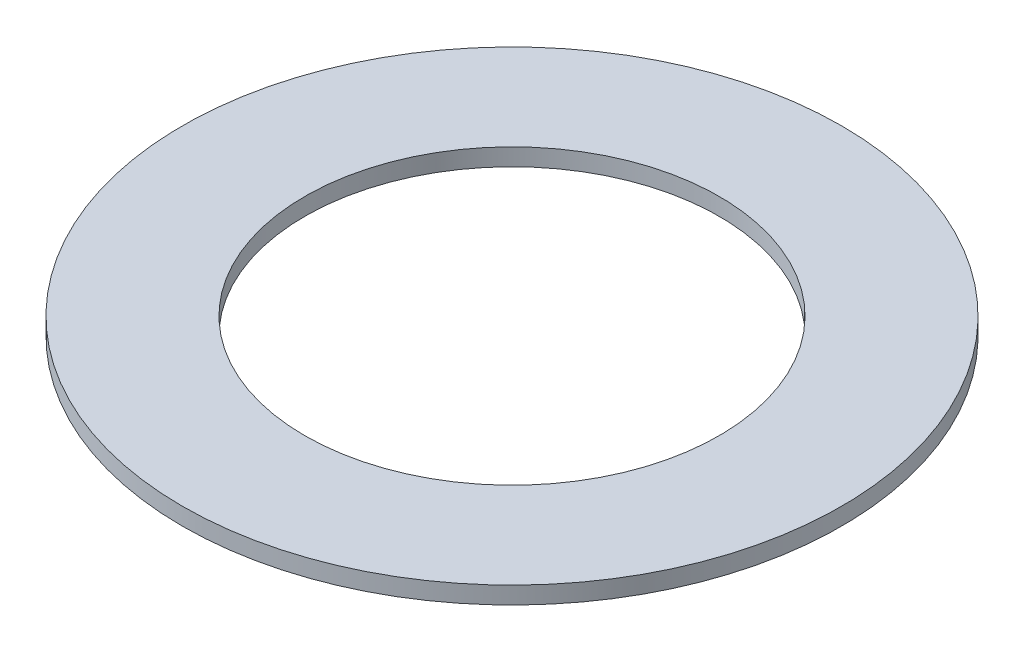
ISO-10303-21;
HEADER;
FILE_DESCRIPTION(('STEP AP214'),'2;1');
FILE_NAME('part.step','',(''),(''),'','','');
FILE_SCHEMA(('AUTOMOTIVE_DESIGN { 1 0 10303 214 1 1 1 1 }'));
ENDSEC;
DATA;
#1=APPLICATION_CONTEXT('core data for automotive mechanical design processes');
#2=APPLICATION_PROTOCOL_DEFINITION('international standard','automotive_design',2000,#1);
#3=PRODUCT_CONTEXT('',#1,'mechanical');
#4=PRODUCT('Part','Part','',(#3));
#5=PRODUCT_RELATED_PRODUCT_CATEGORY('part','',(#4));
#6=PRODUCT_DEFINITION_FORMATION('','',#4);
#7=PRODUCT_DEFINITION_CONTEXT('part definition',#1,'design');
#8=PRODUCT_DEFINITION('design','',#6,#7);
#9=PRODUCT_DEFINITION_SHAPE('','',#8);
#10=(LENGTH_UNIT() NAMED_UNIT(*) SI_UNIT(.MILLI.,.METRE.));
#11=(NAMED_UNIT(*) PLANE_ANGLE_UNIT() SI_UNIT($,.RADIAN.));
#12=(NAMED_UNIT(*) SI_UNIT($,.STERADIAN.) SOLID_ANGLE_UNIT());
#13=UNCERTAINTY_MEASURE_WITH_UNIT(LENGTH_MEASURE(1.E-05),#10,'distance_accuracy_value','');
#14=(GEOMETRIC_REPRESENTATION_CONTEXT(3) GLOBAL_UNCERTAINTY_ASSIGNED_CONTEXT((#13)) GLOBAL_UNIT_ASSIGNED_CONTEXT((#10,
#11,#12)) REPRESENTATION_CONTEXT('',''));
#15=CARTESIAN_POINT('',(0.,0.,0.));
#16=DIRECTION('',(0.,0.,1.));
#17=DIRECTION('',(1.,0.,0.));
#18=AXIS2_PLACEMENT_3D('',#15,#16,#17);
#19=CARTESIAN_POINT('',(0.,0.3,0.));
#20=DIRECTION('',(0.,1.,0.));
#21=DIRECTION('',(0.,0.,1.));
#22=AXIS2_PLACEMENT_3D('',#19,#20,#21);
#23=PLANE('',#22);
#24=CARTESIAN_POINT('',(0.,0.3,0.));
#25=DIRECTION('',(0.,1.,0.));
#26=DIRECTION('',(0.,0.,1.));
#27=AXIS2_PLACEMENT_3D('',#24,#25,#26);
#28=CIRCLE('',#27,5.725);
#29=CARTESIAN_POINT('',(0.,0.3,5.725));
#30=VERTEX_POINT('',#29);
#31=EDGE_CURVE('E10',#30,#30,#28,.T.);
#32=ORIENTED_EDGE('',*,*,#31,.T.);
#33=EDGE_LOOP('',(#32));
#34=FACE_BOUND('',#33,.T.);
#35=CARTESIAN_POINT('',(0.,0.3,0.));
#36=DIRECTION('',(0.,1.,0.));
#37=DIRECTION('',(0.,0.,1.));
#38=AXIS2_PLACEMENT_3D('',#35,#36,#37);
#39=CIRCLE('',#38,3.6);
#40=CARTESIAN_POINT('',(0.,0.3,3.6));
#41=VERTEX_POINT('',#40);
#42=EDGE_CURVE('E53',#41,#41,#39,.T.);
#43=ORIENTED_EDGE('',*,*,#42,.F.);
#44=EDGE_LOOP('',(#43));
#45=FACE_BOUND('',#44,.T.);
#46=ADVANCED_FACE('F39',(#34,#45),#23,.T.);
#47=CARTESIAN_POINT('',(0.,0.,0.));
#48=DIRECTION('',(0.,1.,0.));
#49=DIRECTION('',(0.,0.,1.));
#50=AXIS2_PLACEMENT_3D('',#47,#48,#49);
#51=PLANE('',#50);
#52=CARTESIAN_POINT('',(0.,0.,0.));
#53=DIRECTION('',(0.,1.,0.));
#54=DIRECTION('',(0.,0.,1.));
#55=AXIS2_PLACEMENT_3D('',#52,#53,#54);
#56=CIRCLE('',#55,5.725);
#57=CARTESIAN_POINT('',(0.,0.,5.725));
#58=VERTEX_POINT('',#57);
#59=EDGE_CURVE('E43',#58,#58,#56,.T.);
#60=ORIENTED_EDGE('',*,*,#59,.F.);
#61=EDGE_LOOP('',(#60));
#62=FACE_BOUND('',#61,.T.);
#63=CARTESIAN_POINT('',(0.,0.,0.));
#64=DIRECTION('',(0.,1.,0.));
#65=DIRECTION('',(0.,0.,1.));
#66=AXIS2_PLACEMENT_3D('',#63,#64,#65);
#67=CIRCLE('',#66,3.6);
#68=CARTESIAN_POINT('',(0.,0.,3.6));
#69=VERTEX_POINT('',#68);
#70=EDGE_CURVE('E55',#69,#69,#67,.T.);
#71=ORIENTED_EDGE('',*,*,#70,.T.);
#72=EDGE_LOOP('',(#71));
#73=FACE_BOUND('',#72,.T.);
#74=ADVANCED_FACE('F66',(#62,#73),#51,.F.);
#75=CARTESIAN_POINT('',(0.,0.3,0.));
#76=DIRECTION('',(0.,-1.,0.));
#77=DIRECTION('',(0.,0.,-1.));
#78=AXIS2_PLACEMENT_3D('',#75,#76,#77);
#79=CYLINDRICAL_SURFACE('',#78,5.725);
#80=ORIENTED_EDGE('',*,*,#31,.F.);
#81=EDGE_LOOP('',(#80));
#82=FACE_BOUND('',#81,.T.);
#83=ORIENTED_EDGE('',*,*,#59,.T.);
#84=EDGE_LOOP('',(#83));
#85=FACE_BOUND('',#84,.T.);
#86=ADVANCED_FACE('F41',(#82,#85),#79,.T.);
#87=CARTESIAN_POINT('',(0.,0.3,0.));
#88=DIRECTION('',(0.,-1.,0.));
#89=DIRECTION('',(0.,0.,-1.));
#90=AXIS2_PLACEMENT_3D('',#87,#88,#89);
#91=CYLINDRICAL_SURFACE('',#90,3.6);
#92=ORIENTED_EDGE('',*,*,#42,.T.);
#93=EDGE_LOOP('',(#92));
#94=FACE_BOUND('',#93,.T.);
#95=ORIENTED_EDGE('',*,*,#70,.F.);
#96=EDGE_LOOP('',(#95));
#97=FACE_BOUND('',#96,.T.);
#98=ADVANCED_FACE('F62',(#94,#97),#91,.F.);
#99=CLOSED_SHELL('',(#46,#74,#86,#98));
#100=MANIFOLD_SOLID_BREP('B2',#99);
#101=ADVANCED_BREP_SHAPE_REPRESENTATION('',(#18,#100),#14);
#102=SHAPE_DEFINITION_REPRESENTATION(#9,#101);
ENDSEC;
END-ISO-10303-21;
